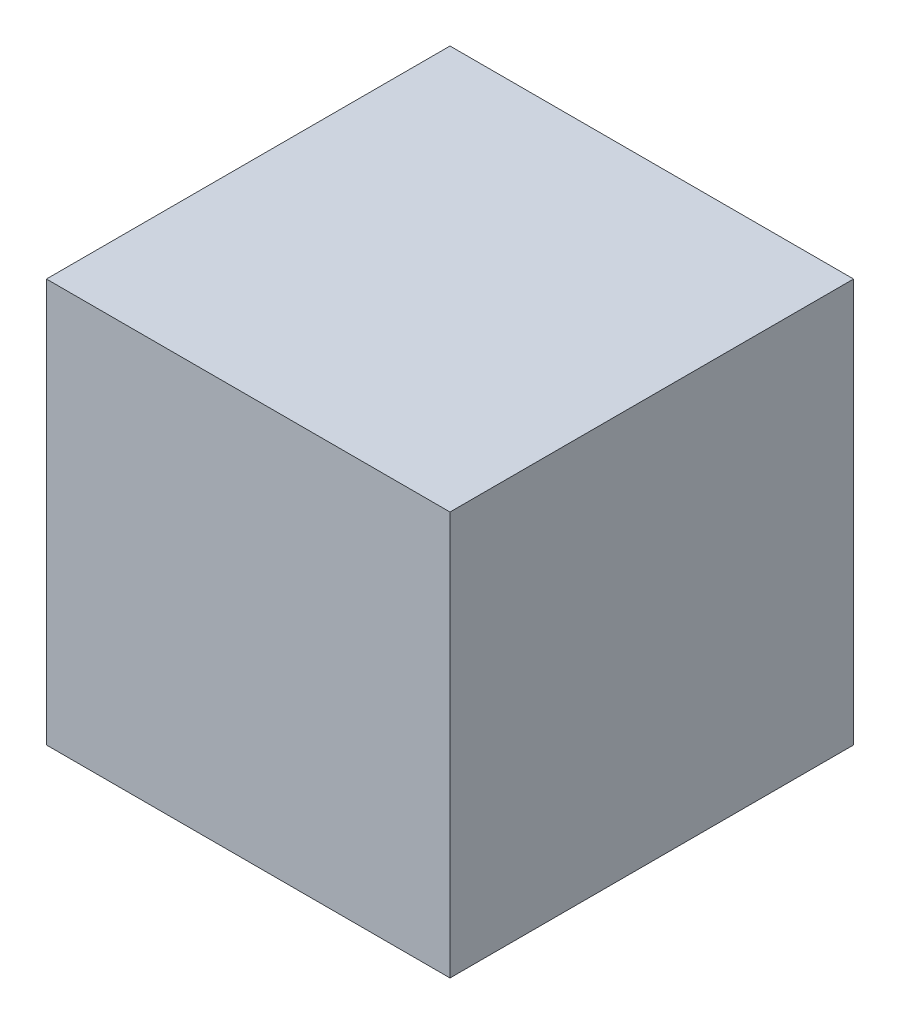
ISO-10303-21;
HEADER;
FILE_DESCRIPTION(('STEP AP214'),'2;1');
FILE_NAME('part.step','',(''),(''),'','','');
FILE_SCHEMA(('AUTOMOTIVE_DESIGN { 1 0 10303 214 1 1 1 1 }'));
ENDSEC;
DATA;
#1=APPLICATION_CONTEXT('core data for automotive mechanical design processes');
#2=APPLICATION_PROTOCOL_DEFINITION('international standard','automotive_design',2000,#1);
#3=PRODUCT_CONTEXT('',#1,'mechanical');
#4=PRODUCT('Part','Part','',(#3));
#5=PRODUCT_RELATED_PRODUCT_CATEGORY('part','',(#4));
#6=PRODUCT_DEFINITION_FORMATION('','',#4);
#7=PRODUCT_DEFINITION_CONTEXT('part definition',#1,'design');
#8=PRODUCT_DEFINITION('design','',#6,#7);
#9=PRODUCT_DEFINITION_SHAPE('','',#8);
#10=(LENGTH_UNIT() NAMED_UNIT(*) SI_UNIT(.MILLI.,.METRE.));
#11=(NAMED_UNIT(*) PLANE_ANGLE_UNIT() SI_UNIT($,.RADIAN.));
#12=(NAMED_UNIT(*) SI_UNIT($,.STERADIAN.) SOLID_ANGLE_UNIT());
#13=UNCERTAINTY_MEASURE_WITH_UNIT(LENGTH_MEASURE(1.E-05),#10,'distance_accuracy_value','');
#14=(GEOMETRIC_REPRESENTATION_CONTEXT(3) GLOBAL_UNCERTAINTY_ASSIGNED_CONTEXT((#13)) GLOBAL_UNIT_ASSIGNED_CONTEXT((#10,
#11,#12)) REPRESENTATION_CONTEXT('',''));
#15=CARTESIAN_POINT('',(0.,0.,0.));
#16=DIRECTION('',(0.,0.,1.));
#17=DIRECTION('',(1.,0.,0.));
#18=AXIS2_PLACEMENT_3D('',#15,#16,#17);
#19=CARTESIAN_POINT('',(0.,22.,0.));
#20=DIRECTION('',(1.,0.,0.));
#21=DIRECTION('',(0.,0.,-1.));
#22=AXIS2_PLACEMENT_3D('',#19,#20,#21);
#23=PLANE('',#22);
#24=DIRECTION('',(0.,0.,1.));
#25=VECTOR('',#24,1.);
#26=CARTESIAN_POINT('',(0.,0.,0.));
#27=LINE('',#26,#25);
#28=CARTESIAN_POINT('',(0.,0.,-22.));
#29=VERTEX_POINT('',#28);
#30=CARTESIAN_POINT('',(0.,0.,0.));
#31=VERTEX_POINT('',#30);
#32=EDGE_CURVE('E94',#29,#31,#27,.T.);
#33=ORIENTED_EDGE('',*,*,#32,.T.);
#34=DIRECTION('',(0.,-1.,0.));
#35=VECTOR('',#34,1.);
#36=CARTESIAN_POINT('',(0.,22.,0.));
#37=LINE('',#36,#35);
#38=CARTESIAN_POINT('',(0.,22.,0.));
#39=VERTEX_POINT('',#38);
#40=EDGE_CURVE('E11',#39,#31,#37,.T.);
#41=ORIENTED_EDGE('',*,*,#40,.F.);
#42=DIRECTION('',(0.,0.,1.));
#43=VECTOR('',#42,1.);
#44=CARTESIAN_POINT('',(0.,22.,0.));
#45=LINE('',#44,#43);
#46=CARTESIAN_POINT('',(0.,22.,-22.));
#47=VERTEX_POINT('',#46);
#48=EDGE_CURVE('E82',#47,#39,#45,.T.);
#49=ORIENTED_EDGE('',*,*,#48,.F.);
#50=DIRECTION('',(0.,-1.,0.));
#51=VECTOR('',#50,1.);
#52=CARTESIAN_POINT('',(0.,22.,-22.));
#53=LINE('',#52,#51);
#54=EDGE_CURVE('E90',#47,#29,#53,.T.);
#55=ORIENTED_EDGE('',*,*,#54,.T.);
#56=EDGE_LOOP('',(#33,#41,#49,#55));
#57=FACE_BOUND('',#56,.T.);
#58=ADVANCED_FACE('F31',(#57),#23,.F.);
#59=CARTESIAN_POINT('',(0.,22.,0.));
#60=DIRECTION('',(0.,0.,-1.));
#61=DIRECTION('',(-1.,0.,0.));
#62=AXIS2_PLACEMENT_3D('',#59,#60,#61);
#63=PLANE('',#62);
#64=DIRECTION('',(1.,0.,0.));
#65=VECTOR('',#64,1.);
#66=CARTESIAN_POINT('',(0.,0.,0.));
#67=LINE('',#66,#65);
#68=CARTESIAN_POINT('',(22.,0.,0.));
#69=VERTEX_POINT('',#68);
#70=EDGE_CURVE('E86',#31,#69,#67,.T.);
#71=ORIENTED_EDGE('',*,*,#70,.T.);
#72=DIRECTION('',(0.,-1.,0.));
#73=VECTOR('',#72,1.);
#74=CARTESIAN_POINT('',(22.,22.,0.));
#75=LINE('',#74,#73);
#76=CARTESIAN_POINT('',(22.,22.,0.));
#77=VERTEX_POINT('',#76);
#78=EDGE_CURVE('E39',#77,#69,#75,.T.);
#79=ORIENTED_EDGE('',*,*,#78,.F.);
#80=DIRECTION('',(1.,0.,0.));
#81=VECTOR('',#80,1.);
#82=CARTESIAN_POINT('',(0.,22.,0.));
#83=LINE('',#82,#81);
#84=EDGE_CURVE('E77',#39,#77,#83,.T.);
#85=ORIENTED_EDGE('',*,*,#84,.F.);
#86=ORIENTED_EDGE('',*,*,#40,.T.);
#87=EDGE_LOOP('',(#71,#79,#85,#86));
#88=FACE_BOUND('',#87,.T.);
#89=ADVANCED_FACE('F85',(#88),#63,.F.);
#90=CARTESIAN_POINT('',(22.,22.,0.));
#91=DIRECTION('',(-1.,0.,0.));
#92=DIRECTION('',(0.,0.,1.));
#93=AXIS2_PLACEMENT_3D('',#90,#91,#92);
#94=PLANE('',#93);
#95=DIRECTION('',(0.,0.,-1.));
#96=VECTOR('',#95,1.);
#97=CARTESIAN_POINT('',(22.,0.,0.));
#98=LINE('',#97,#96);
#99=CARTESIAN_POINT('',(22.,0.,-22.));
#100=VERTEX_POINT('',#99);
#101=EDGE_CURVE('E64',#69,#100,#98,.T.);
#102=ORIENTED_EDGE('',*,*,#101,.T.);
#103=DIRECTION('',(0.,-1.,0.));
#104=VECTOR('',#103,1.);
#105=CARTESIAN_POINT('',(22.,22.,-22.));
#106=LINE('',#105,#104);
#107=CARTESIAN_POINT('',(22.,22.,-22.));
#108=VERTEX_POINT('',#107);
#109=EDGE_CURVE('E87',#108,#100,#106,.T.);
#110=ORIENTED_EDGE('',*,*,#109,.F.);
#111=DIRECTION('',(0.,0.,-1.));
#112=VECTOR('',#111,1.);
#113=CARTESIAN_POINT('',(22.,22.,0.));
#114=LINE('',#113,#112);
#115=EDGE_CURVE('E80',#77,#108,#114,.T.);
#116=ORIENTED_EDGE('',*,*,#115,.F.);
#117=ORIENTED_EDGE('',*,*,#78,.T.);
#118=EDGE_LOOP('',(#102,#110,#116,#117));
#119=FACE_BOUND('',#118,.T.);
#120=ADVANCED_FACE('F88',(#119),#94,.F.);
#121=CARTESIAN_POINT('',(0.,22.,-22.));
#122=DIRECTION('',(0.,0.,1.));
#123=DIRECTION('',(1.,0.,0.));
#124=AXIS2_PLACEMENT_3D('',#121,#122,#123);
#125=PLANE('',#124);
#126=DIRECTION('',(-1.,0.,0.));
#127=VECTOR('',#126,1.);
#128=CARTESIAN_POINT('',(0.,0.,-22.));
#129=LINE('',#128,#127);
#130=EDGE_CURVE('E70',#100,#29,#129,.T.);
#131=ORIENTED_EDGE('',*,*,#130,.T.);
#132=ORIENTED_EDGE('',*,*,#54,.F.);
#133=DIRECTION('',(-1.,0.,0.));
#134=VECTOR('',#133,1.);
#135=CARTESIAN_POINT('',(0.,22.,-22.));
#136=LINE('',#135,#134);
#137=EDGE_CURVE('E47',#108,#47,#136,.T.);
#138=ORIENTED_EDGE('',*,*,#137,.F.);
#139=ORIENTED_EDGE('',*,*,#109,.T.);
#140=EDGE_LOOP('',(#131,#132,#138,#139));
#141=FACE_BOUND('',#140,.T.);
#142=ADVANCED_FACE('F101',(#141),#125,.F.);
#143=CARTESIAN_POINT('',(0.,22.,-22.));
#144=DIRECTION('',(0.,-1.,0.));
#145=DIRECTION('',(0.,0.,-1.));
#146=AXIS2_PLACEMENT_3D('',#143,#144,#145);
#147=PLANE('',#146);
#148=ORIENTED_EDGE('',*,*,#48,.T.);
#149=ORIENTED_EDGE('',*,*,#84,.T.);
#150=ORIENTED_EDGE('',*,*,#115,.T.);
#151=ORIENTED_EDGE('',*,*,#137,.T.);
#152=EDGE_LOOP('',(#148,#149,#150,#151));
#153=FACE_BOUND('',#152,.T.);
#154=ADVANCED_FACE('F78',(#153),#147,.F.);
#155=CARTESIAN_POINT('',(0.,0.,-22.));
#156=DIRECTION('',(0.,-1.,0.));
#157=DIRECTION('',(0.,0.,-1.));
#158=AXIS2_PLACEMENT_3D('',#155,#156,#157);
#159=PLANE('',#158);
#160=ORIENTED_EDGE('',*,*,#32,.F.);
#161=ORIENTED_EDGE('',*,*,#130,.F.);
#162=ORIENTED_EDGE('',*,*,#101,.F.);
#163=ORIENTED_EDGE('',*,*,#70,.F.);
#164=EDGE_LOOP('',(#160,#161,#162,#163));
#165=FACE_BOUND('',#164,.T.);
#166=ADVANCED_FACE('F104',(#165),#159,.T.);
#167=CLOSED_SHELL('',(#58,#89,#120,#142,#154,#166));
#168=MANIFOLD_SOLID_BREP('B2',#167);
#169=ADVANCED_BREP_SHAPE_REPRESENTATION('',(#18,#168),#14);
#170=SHAPE_DEFINITION_REPRESENTATION(#9,#169);
ENDSEC;
END-ISO-10303-21;
